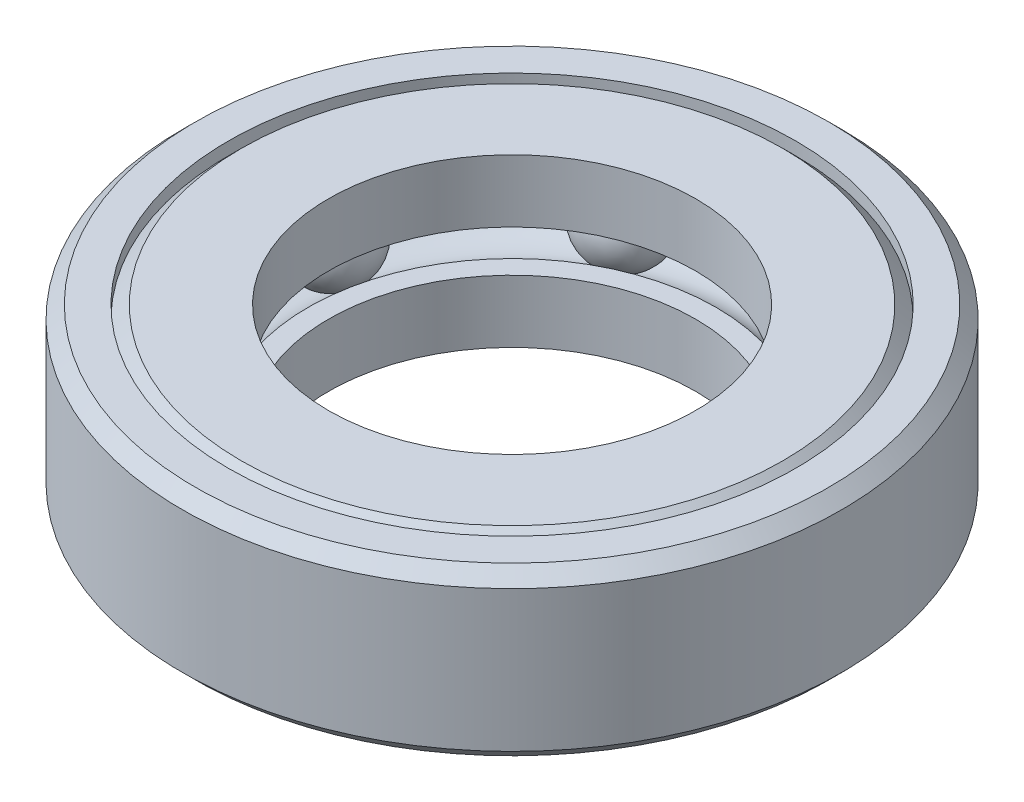
ISO-10303-21;
HEADER;
FILE_DESCRIPTION(('STEP AP214'),'2;1');
FILE_NAME('part.step','',(''),(''),'','','');
FILE_SCHEMA(('AUTOMOTIVE_DESIGN { 1 0 10303 214 1 1 1 1 }'));
ENDSEC;
DATA;
#1=APPLICATION_CONTEXT('core data for automotive mechanical design processes');
#2=APPLICATION_PROTOCOL_DEFINITION('international standard','automotive_design',2000,#1);
#3=PRODUCT_CONTEXT('',#1,'mechanical');
#4=PRODUCT('Part','Part','',(#3));
#5=PRODUCT_RELATED_PRODUCT_CATEGORY('part','',(#4));
#6=PRODUCT_DEFINITION_FORMATION('','',#4);
#7=PRODUCT_DEFINITION_CONTEXT('part definition',#1,'design');
#8=PRODUCT_DEFINITION('design','',#6,#7);
#9=PRODUCT_DEFINITION_SHAPE('','',#8);
#10=(LENGTH_UNIT() NAMED_UNIT(*) SI_UNIT(.MILLI.,.METRE.));
#11=(NAMED_UNIT(*) PLANE_ANGLE_UNIT() SI_UNIT($,.RADIAN.));
#12=(NAMED_UNIT(*) SI_UNIT($,.STERADIAN.) SOLID_ANGLE_UNIT());
#13=UNCERTAINTY_MEASURE_WITH_UNIT(LENGTH_MEASURE(1.E-05),#10,'distance_accuracy_value','');
#14=(GEOMETRIC_REPRESENTATION_CONTEXT(3) GLOBAL_UNCERTAINTY_ASSIGNED_CONTEXT((#13)) GLOBAL_UNIT_ASSIGNED_CONTEXT((#10,
#11,#12)) REPRESENTATION_CONTEXT('',''));
#15=CARTESIAN_POINT('',(0.,0.,0.));
#16=DIRECTION('',(0.,0.,1.));
#17=DIRECTION('',(1.,0.,0.));
#18=AXIS2_PLACEMENT_3D('',#15,#16,#17);
#19=CARTESIAN_POINT('',(17.8571532207388,0.,14.2406044947352));
#20=DIRECTION('',(0.,1.,0.));
#21=DIRECTION('',(-0.781831482468022,0.,-0.623489801858743));
#22=AXIS2_PLACEMENT_3D('',#19,#20,#21);
#23=SPHERICAL_SURFACE('',#22,3.96875);
#24=CARTESIAN_POINT('',(17.8571532207388,3.96875,14.2406044947352));
#25=VERTEX_POINT('',#24);
#26=VERTEX_LOOP('',#25);
#27=FACE_BOUND('',#26,.T.);
#28=ADVANCED_FACE('F42',(#27),#23,.T.);
#29=CLOSED_SHELL('',(#28));
#30=MANIFOLD_SOLID_BREP('B2',#29);
#31=CARTESIAN_POINT('',(22.2675058467192,0.,-5.08241290045794));
#32=DIRECTION('',(0.,1.,0.));
#33=DIRECTION('',(-0.974927912181826,0.,0.222520933956305));
#34=AXIS2_PLACEMENT_3D('',#31,#32,#33);
#35=SPHERICAL_SURFACE('',#34,3.96875);
#36=CARTESIAN_POINT('',(22.2675058467192,3.96875,-5.08241290045794));
#37=VERTEX_POINT('',#36);
#38=VERTEX_LOOP('',#37);
#39=FACE_BOUND('',#38,.T.);
#40=ADVANCED_FACE('F59',(#39),#35,.T.);
#41=CLOSED_SHELL('',(#40));
#42=MANIFOLD_SOLID_BREP('B6',#41);
#43=CARTESIAN_POINT('',(9.90997239577943,0.,-20.5782697192768));
#44=DIRECTION('',(0.,1.,0.));
#45=DIRECTION('',(-0.433883739117565,0.,0.900968867902416));
#46=AXIS2_PLACEMENT_3D('',#43,#44,#45);
#47=SPHERICAL_SURFACE('',#46,3.96875);
#48=CARTESIAN_POINT('',(9.90997239577943,3.96875000000001,-20.5782697192768));
#49=VERTEX_POINT('',#48);
#50=VERTEX_LOOP('',#49);
#51=FACE_BOUND('',#50,.T.);
#52=ADVANCED_FACE('F76',(#51),#47,.T.);
#53=CLOSED_SHELL('',(#52));
#54=MANIFOLD_SOLID_BREP('B38',#53);
#55=CARTESIAN_POINT('',(-9.90997239577914,0.,-20.5782697192769));
#56=DIRECTION('',(0.,1.,0.));
#57=DIRECTION('',(0.433883739117553,0.,0.900968867902422));
#58=AXIS2_PLACEMENT_3D('',#55,#56,#57);
#59=SPHERICAL_SURFACE('',#58,3.96875);
#60=CARTESIAN_POINT('',(-9.90997239577914,3.96875000000001,-20.5782697192769));
#61=VERTEX_POINT('',#60);
#62=VERTEX_LOOP('',#61);
#63=FACE_BOUND('',#62,.T.);
#64=ADVANCED_FACE('F93',(#63),#59,.T.);
#65=CLOSED_SHELL('',(#64));
#66=MANIFOLD_SOLID_BREP('B55',#65);
#67=CARTESIAN_POINT('',(-22.2675058467191,0.,-5.08241290045824));
#68=DIRECTION('',(0.,1.,0.));
#69=DIRECTION('',(0.974927912181823,0.,0.222520933956318));
#70=AXIS2_PLACEMENT_3D('',#67,#68,#69);
#71=SPHERICAL_SURFACE('',#70,3.96875);
#72=CARTESIAN_POINT('',(-22.2675058467191,3.96875,-5.08241290045824));
#73=VERTEX_POINT('',#72);
#74=VERTEX_LOOP('',#73);
#75=FACE_BOUND('',#74,.T.);
#76=ADVANCED_FACE('F110',(#75),#71,.T.);
#77=CLOSED_SHELL('',(#76));
#78=MANIFOLD_SOLID_BREP('B72',#77);
#79=CARTESIAN_POINT('',(-17.857153220739,0.,14.240604494735));
#80=DIRECTION('',(0.,1.,0.));
#81=DIRECTION('',(0.781831482468031,0.,-0.623489801858732));
#82=AXIS2_PLACEMENT_3D('',#79,#80,#81);
#83=SPHERICAL_SURFACE('',#82,3.96875);
#84=CARTESIAN_POINT('',(-17.857153220739,3.96875,14.240604494735));
#85=VERTEX_POINT('',#84);
#86=VERTEX_LOOP('',#85);
#87=FACE_BOUND('',#86,.T.);
#88=ADVANCED_FACE('F127',(#87),#83,.T.);
#89=CLOSED_SHELL('',(#88));
#90=MANIFOLD_SOLID_BREP('B89',#89);
#91=CARTESIAN_POINT('',(0.,0.,22.84015625));
#92=DIRECTION('',(0.,1.,0.));
#93=DIRECTION('',(0.,0.,-1.));
#94=AXIS2_PLACEMENT_3D('',#91,#92,#93);
#95=SPHERICAL_SURFACE('',#94,3.96875);
#96=CARTESIAN_POINT('',(0.,3.96875,22.84015625));
#97=VERTEX_POINT('',#96);
#98=VERTEX_LOOP('',#97);
#99=FACE_BOUND('',#98,.T.);
#100=ADVANCED_FACE('F146',(#99),#95,.T.);
#101=CLOSED_SHELL('',(#100));
#102=MANIFOLD_SOLID_BREP('B106',#101);
#103=CARTESIAN_POINT('',(0.,5.47163488649767,0.));
#104=DIRECTION('',(0.,-1.,0.));
#105=DIRECTION('',(0.,0.,-1.));
#106=AXIS2_PLACEMENT_3D('',#103,#104,#105);
#107=CONICAL_SURFACE('',#106,28.2178125,0.785398163397453);
#108=CARTESIAN_POINT('',(0.,6.70456744324884,0.));
#109=DIRECTION('',(0.,-1.,0.));
#110=DIRECTION('',(0.,0.,-1.));
#111=AXIS2_PLACEMENT_3D('',#108,#109,#110);
#112=CIRCLE('',#111,26.9848799432488);
#113=CARTESIAN_POINT('',(0.,6.70456744324884,-26.9848799432488));
#114=VERTEX_POINT('',#113);
#115=EDGE_CURVE('E145',#114,#114,#112,.T.);
#116=ORIENTED_EDGE('',*,*,#115,.F.);
#117=EDGE_LOOP('',(#116));
#118=FACE_BOUND('',#117,.T.);
#119=CARTESIAN_POINT('',(0.,5.47163488649767,0.));
#120=DIRECTION('',(0.,-1.,0.));
#121=DIRECTION('',(0.,0.,-1.));
#122=AXIS2_PLACEMENT_3D('',#119,#120,#121);
#123=CIRCLE('',#122,28.2178125);
#124=CARTESIAN_POINT('',(0.,5.47163488649768,-28.2178125));
#125=VERTEX_POINT('',#124);
#126=EDGE_CURVE('E199',#125,#125,#123,.T.);
#127=ORIENTED_EDGE('',*,*,#126,.T.);
#128=EDGE_LOOP('',(#127));
#129=FACE_BOUND('',#128,.T.);
#130=ADVANCED_FACE('F165',(#118,#129),#107,.F.);
#131=CARTESIAN_POINT('',(0.,-7.93750000000001,0.));
#132=DIRECTION('',(0.,-1.,0.));
#133=DIRECTION('',(0.,0.,-1.));
#134=AXIS2_PLACEMENT_3D('',#131,#132,#133);
#135=CYLINDRICAL_SURFACE('',#134,26.9848799432488);
#136=CARTESIAN_POINT('',(0.,7.9375,0.));
#137=DIRECTION('',(0.,-1.,0.));
#138=DIRECTION('',(0.,0.,-1.));
#139=AXIS2_PLACEMENT_3D('',#136,#137,#138);
#140=CIRCLE('',#139,26.9848799432488);
#141=CARTESIAN_POINT('',(0.,7.93750000000001,-26.9848799432488));
#142=VERTEX_POINT('',#141);
#143=EDGE_CURVE('E171',#142,#142,#140,.T.);
#144=ORIENTED_EDGE('',*,*,#143,.F.);
#145=EDGE_LOOP('',(#144));
#146=FACE_BOUND('',#145,.T.);
#147=ORIENTED_EDGE('',*,*,#115,.T.);
#148=EDGE_LOOP('',(#147));
#149=FACE_BOUND('',#148,.T.);
#150=ADVANCED_FACE('F248',(#146,#149),#135,.F.);
#151=CARTESIAN_POINT('',(0.,7.9375,30.1201924432488));
#152=DIRECTION('',(0.,-1.,0.));
#153=DIRECTION('',(0.,0.,-1.));
#154=AXIS2_PLACEMENT_3D('',#151,#152,#153);
#155=PLANE('',#154);
#156=CARTESIAN_POINT('',(0.,7.93750000000001,0.));
#157=DIRECTION('',(0.,-1.,0.));
#158=DIRECTION('',(0.,0.,-1.));
#159=AXIS2_PLACEMENT_3D('',#156,#157,#158);
#160=CIRCLE('',#159,30.1201924432488);
#161=CARTESIAN_POINT('',(0.,7.93750000000001,-30.1201924432488));
#162=VERTEX_POINT('',#161);
#163=EDGE_CURVE('E175',#162,#162,#160,.T.);
#164=ORIENTED_EDGE('',*,*,#163,.F.);
#165=EDGE_LOOP('',(#164));
#166=FACE_BOUND('',#165,.T.);
#167=ORIENTED_EDGE('',*,*,#143,.T.);
#168=EDGE_LOOP('',(#167));
#169=FACE_BOUND('',#168,.T.);
#170=ADVANCED_FACE('F243',(#166,#169),#155,.F.);
#171=CARTESIAN_POINT('',(0.,7.93750000000001,0.));
#172=DIRECTION('',(0.,-1.,0.));
#173=DIRECTION('',(0.,0.,-1.));
#174=AXIS2_PLACEMENT_3D('',#171,#172,#173);
#175=CONICAL_SURFACE('',#174,30.1201924432488,0.785398163397455);
#176=CARTESIAN_POINT('',(0.,6.70456744324884,0.));
#177=DIRECTION('',(0.,-1.,0.));
#178=DIRECTION('',(0.,0.,-1.));
#179=AXIS2_PLACEMENT_3D('',#176,#177,#178);
#180=CIRCLE('',#179,31.353125);
#181=CARTESIAN_POINT('',(0.,6.70456744324884,-31.353125));
#182=VERTEX_POINT('',#181);
#183=EDGE_CURVE('E179',#182,#182,#180,.T.);
#184=ORIENTED_EDGE('',*,*,#183,.F.);
#185=EDGE_LOOP('',(#184));
#186=FACE_BOUND('',#185,.T.);
#187=ORIENTED_EDGE('',*,*,#163,.T.);
#188=EDGE_LOOP('',(#187));
#189=FACE_BOUND('',#188,.T.);
#190=ADVANCED_FACE('F237',(#186,#189),#175,.T.);
#191=CARTESIAN_POINT('',(0.,-7.93750000000001,0.));
#192=DIRECTION('',(0.,-1.,0.));
#193=DIRECTION('',(0.,0.,-1.));
#194=AXIS2_PLACEMENT_3D('',#191,#192,#193);
#195=CYLINDRICAL_SURFACE('',#194,31.353125);
#196=CARTESIAN_POINT('',(0.,-6.70456744324885,0.));
#197=DIRECTION('',(0.,-1.,0.));
#198=DIRECTION('',(0.,0.,-1.));
#199=AXIS2_PLACEMENT_3D('',#196,#197,#198);
#200=CIRCLE('',#199,31.353125);
#201=CARTESIAN_POINT('',(0.,-6.70456744324885,-31.353125));
#202=VERTEX_POINT('',#201);
#203=EDGE_CURVE('E184',#202,#202,#200,.T.);
#204=ORIENTED_EDGE('',*,*,#203,.F.);
#205=EDGE_LOOP('',(#204));
#206=FACE_BOUND('',#205,.T.);
#207=ORIENTED_EDGE('',*,*,#183,.T.);
#208=EDGE_LOOP('',(#207));
#209=FACE_BOUND('',#208,.T.);
#210=ADVANCED_FACE('F231',(#206,#209),#195,.T.);
#211=CARTESIAN_POINT('',(0.,-6.70456744324885,0.));
#212=DIRECTION('',(0.,1.,0.));
#213=DIRECTION('',(0.,0.,1.));
#214=AXIS2_PLACEMENT_3D('',#211,#212,#213);
#215=CONICAL_SURFACE('',#214,31.353125,0.785398163397455);
#216=CARTESIAN_POINT('',(0.,-7.93750000000002,0.));
#217=DIRECTION('',(0.,-1.,0.));
#218=DIRECTION('',(0.,0.,-1.));
#219=AXIS2_PLACEMENT_3D('',#216,#217,#218);
#220=CIRCLE('',#219,30.1201924432488);
#221=CARTESIAN_POINT('',(0.,-7.93750000000002,-30.1201924432488));
#222=VERTEX_POINT('',#221);
#223=EDGE_CURVE('E187',#222,#222,#220,.T.);
#224=ORIENTED_EDGE('',*,*,#223,.F.);
#225=EDGE_LOOP('',(#224));
#226=FACE_BOUND('',#225,.T.);
#227=ORIENTED_EDGE('',*,*,#203,.T.);
#228=EDGE_LOOP('',(#227));
#229=FACE_BOUND('',#228,.T.);
#230=ADVANCED_FACE('F225',(#226,#229),#215,.T.);
#231=CARTESIAN_POINT('',(0.,-7.93750000000002,30.1201924432488));
#232=DIRECTION('',(0.,1.,0.));
#233=DIRECTION('',(0.,0.,1.));
#234=AXIS2_PLACEMENT_3D('',#231,#232,#233);
#235=PLANE('',#234);
#236=CARTESIAN_POINT('',(0.,-7.93750000000002,0.));
#237=DIRECTION('',(0.,-1.,0.));
#238=DIRECTION('',(0.,0.,-1.));
#239=AXIS2_PLACEMENT_3D('',#236,#237,#238);
#240=CIRCLE('',#239,26.9848799432488);
#241=CARTESIAN_POINT('',(0.,-7.93750000000001,-26.9848799432488));
#242=VERTEX_POINT('',#241);
#243=EDGE_CURVE('E190',#242,#242,#240,.T.);
#244=ORIENTED_EDGE('',*,*,#243,.F.);
#245=EDGE_LOOP('',(#244));
#246=FACE_BOUND('',#245,.T.);
#247=ORIENTED_EDGE('',*,*,#223,.T.);
#248=EDGE_LOOP('',(#247));
#249=FACE_BOUND('',#248,.T.);
#250=ADVANCED_FACE('F219',(#246,#249),#235,.F.);
#251=CARTESIAN_POINT('',(0.,-7.93750000000001,0.));
#252=DIRECTION('',(0.,-1.,0.));
#253=DIRECTION('',(0.,0.,-1.));
#254=AXIS2_PLACEMENT_3D('',#251,#252,#253);
#255=CYLINDRICAL_SURFACE('',#254,26.9848799432488);
#256=CARTESIAN_POINT('',(0.,-6.70456744324885,0.));
#257=DIRECTION('',(0.,-1.,0.));
#258=DIRECTION('',(0.,0.,-1.));
#259=AXIS2_PLACEMENT_3D('',#256,#257,#258);
#260=CIRCLE('',#259,26.9848799432488);
#261=CARTESIAN_POINT('',(0.,-6.70456744324885,-26.9848799432488));
#262=VERTEX_POINT('',#261);
#263=EDGE_CURVE('E193',#262,#262,#260,.T.);
#264=ORIENTED_EDGE('',*,*,#263,.F.);
#265=EDGE_LOOP('',(#264));
#266=FACE_BOUND('',#265,.T.);
#267=ORIENTED_EDGE('',*,*,#243,.T.);
#268=EDGE_LOOP('',(#267));
#269=FACE_BOUND('',#268,.T.);
#270=ADVANCED_FACE('F213',(#266,#269),#255,.F.);
#271=CARTESIAN_POINT('',(0.,-6.70456744324885,0.));
#272=DIRECTION('',(0.,1.,0.));
#273=DIRECTION('',(0.,0.,1.));
#274=AXIS2_PLACEMENT_3D('',#271,#272,#273);
#275=CONICAL_SURFACE('',#274,26.9848799432488,0.785398163397447);
#276=CARTESIAN_POINT('',(0.,-5.47163488649768,0.));
#277=DIRECTION('',(0.,-1.,0.));
#278=DIRECTION('',(0.,0.,-1.));
#279=AXIS2_PLACEMENT_3D('',#276,#277,#278);
#280=CIRCLE('',#279,28.2178125);
#281=CARTESIAN_POINT('',(0.,-5.47163488649767,-28.2178125));
#282=VERTEX_POINT('',#281);
#283=EDGE_CURVE('E196',#282,#282,#280,.T.);
#284=ORIENTED_EDGE('',*,*,#283,.F.);
#285=EDGE_LOOP('',(#284));
#286=FACE_BOUND('',#285,.T.);
#287=ORIENTED_EDGE('',*,*,#263,.T.);
#288=EDGE_LOOP('',(#287));
#289=FACE_BOUND('',#288,.T.);
#290=ADVANCED_FACE('F207',(#286,#289),#275,.F.);
#291=CARTESIAN_POINT('',(0.,-7.93750000000001,0.));
#292=DIRECTION('',(0.,-1.,0.));
#293=DIRECTION('',(0.,0.,-1.));
#294=AXIS2_PLACEMENT_3D('',#291,#292,#293);
#295=CYLINDRICAL_SURFACE('',#294,28.2178125);
#296=ORIENTED_EDGE('',*,*,#126,.F.);
#297=EDGE_LOOP('',(#296));
#298=FACE_BOUND('',#297,.T.);
#299=ORIENTED_EDGE('',*,*,#283,.T.);
#300=EDGE_LOOP('',(#299));
#301=FACE_BOUND('',#300,.T.);
#302=ADVANCED_FACE('F204',(#298,#301),#295,.F.);
#303=CLOSED_SHELL('',(#130,#150,#170,#190,#210,#230,#250,#270,#290,#302));
#304=MANIFOLD_SOLID_BREP('B123',#303);
#305=CARTESIAN_POINT('',(0.,0.,0.));
#306=DIRECTION('',(0.,-1.,0.));
#307=DIRECTION('',(0.,0.,-1.));
#308=AXIS2_PLACEMENT_3D('',#305,#306,#307);
#309=TOROIDAL_SURFACE('',#308,22.84015625,3.96875000000001);
#310=CARTESIAN_POINT('',(0.,-1.98437500000002,0.));
#311=DIRECTION('',(0.,-1.,0.));
#312=DIRECTION('',(0.,0.,-1.));
#313=AXIS2_PLACEMENT_3D('',#310,#311,#312);
#314=CIRCLE('',#313,26.2771945712695);
#315=CARTESIAN_POINT('',(0.,-1.98437500000001,-26.2771945712695));
#316=VERTEX_POINT('',#315);
#317=EDGE_CURVE('E164',#316,#316,#314,.T.);
#318=ORIENTED_EDGE('',*,*,#317,.F.);
#319=EDGE_LOOP('',(#318));
#320=FACE_BOUND('',#319,.T.);
#321=CARTESIAN_POINT('',(0.,-1.98437500000002,0.));
#322=DIRECTION('',(0.,-1.,0.));
#323=DIRECTION('',(0.,0.,-1.));
#324=AXIS2_PLACEMENT_3D('',#321,#322,#323);
#325=CIRCLE('',#324,19.4031179287305);
#326=CARTESIAN_POINT('',(0.,-1.98437500000001,-19.4031179287305));
#327=VERTEX_POINT('',#326);
#328=EDGE_CURVE('E329',#327,#327,#325,.T.);
#329=ORIENTED_EDGE('',*,*,#328,.T.);
#330=EDGE_LOOP('',(#329));
#331=FACE_BOUND('',#330,.T.);
#332=ADVANCED_FACE('F304',(#320,#331),#309,.F.);
#333=CARTESIAN_POINT('',(0.,-1.98437500000002,26.2771945712695));
#334=DIRECTION('',(0.,-1.,0.));
#335=DIRECTION('',(0.,0.,-1.));
#336=AXIS2_PLACEMENT_3D('',#333,#334,#335);
#337=PLANE('',#336);
#338=CARTESIAN_POINT('',(0.,-1.98437500000002,0.));
#339=DIRECTION('',(0.,-1.,0.));
#340=DIRECTION('',(0.,0.,-1.));
#341=AXIS2_PLACEMENT_3D('',#338,#339,#340);
#342=CIRCLE('',#341,28.2178125);
#343=CARTESIAN_POINT('',(0.,-1.98437500000001,-28.2178125));
#344=VERTEX_POINT('',#343);
#345=EDGE_CURVE('E310',#344,#344,#342,.T.);
#346=ORIENTED_EDGE('',*,*,#345,.F.);
#347=EDGE_LOOP('',(#346));
#348=FACE_BOUND('',#347,.T.);
#349=ORIENTED_EDGE('',*,*,#317,.T.);
#350=EDGE_LOOP('',(#349));
#351=FACE_BOUND('',#350,.T.);
#352=ADVANCED_FACE('F360',(#348,#351),#337,.F.);
#353=CARTESIAN_POINT('',(0.,-7.93750000000001,0.));
#354=DIRECTION('',(0.,-1.,0.));
#355=DIRECTION('',(0.,0.,-1.));
#356=AXIS2_PLACEMENT_3D('',#353,#354,#355);
#357=CYLINDRICAL_SURFACE('',#356,28.2178125);
#358=CARTESIAN_POINT('',(0.,-5.47163488649769,0.));
#359=DIRECTION('',(0.,-1.,0.));
#360=DIRECTION('',(0.,0.,-1.));
#361=AXIS2_PLACEMENT_3D('',#358,#359,#360);
#362=CIRCLE('',#361,28.2178125);
#363=CARTESIAN_POINT('',(0.,-5.47163488649769,-28.2178125));
#364=VERTEX_POINT('',#363);
#365=EDGE_CURVE('E314',#364,#364,#362,.T.);
#366=ORIENTED_EDGE('',*,*,#365,.F.);
#367=EDGE_LOOP('',(#366));
#368=FACE_BOUND('',#367,.T.);
#369=ORIENTED_EDGE('',*,*,#345,.T.);
#370=EDGE_LOOP('',(#369));
#371=FACE_BOUND('',#370,.T.);
#372=ADVANCED_FACE('F355',(#368,#371),#357,.T.);
#373=CARTESIAN_POINT('',(0.,-5.47163488649769,0.));
#374=DIRECTION('',(0.,1.,0.));
#375=DIRECTION('',(0.,0.,1.));
#376=AXIS2_PLACEMENT_3D('',#373,#374,#375);
#377=CONICAL_SURFACE('',#376,28.2178125,0.78539816339745);
#378=CARTESIAN_POINT('',(0.,-7.93750000000002,0.));
#379=DIRECTION('',(0.,-1.,0.));
#380=DIRECTION('',(0.,0.,-1.));
#381=AXIS2_PLACEMENT_3D('',#378,#379,#380);
#382=CIRCLE('',#381,25.7519473864977);
#383=CARTESIAN_POINT('',(0.,-7.93750000000001,-25.7519473864977));
#384=VERTEX_POINT('',#383);
#385=EDGE_CURVE('E318',#384,#384,#382,.T.);
#386=ORIENTED_EDGE('',*,*,#385,.F.);
#387=EDGE_LOOP('',(#386));
#388=FACE_BOUND('',#387,.T.);
#389=ORIENTED_EDGE('',*,*,#365,.T.);
#390=EDGE_LOOP('',(#389));
#391=FACE_BOUND('',#390,.T.);
#392=ADVANCED_FACE('F349',(#388,#391),#377,.T.);
#393=CARTESIAN_POINT('',(0.,-7.93750000000002,25.7519473864977));
#394=DIRECTION('',(0.,1.,0.));
#395=DIRECTION('',(0.,0.,1.));
#396=AXIS2_PLACEMENT_3D('',#393,#394,#395);
#397=PLANE('',#396);
#398=CARTESIAN_POINT('',(0.,-7.93750000000001,0.));
#399=DIRECTION('',(0.,-1.,0.));
#400=DIRECTION('',(0.,0.,-1.));
#401=AXIS2_PLACEMENT_3D('',#398,#399,#400);
#402=CIRCLE('',#401,17.4625);
#403=CARTESIAN_POINT('',(0.,-7.93750000000001,-17.4625));
#404=VERTEX_POINT('',#403);
#405=EDGE_CURVE('E323',#404,#404,#402,.T.);
#406=ORIENTED_EDGE('',*,*,#405,.F.);
#407=EDGE_LOOP('',(#406));
#408=FACE_BOUND('',#407,.T.);
#409=ORIENTED_EDGE('',*,*,#385,.T.);
#410=EDGE_LOOP('',(#409));
#411=FACE_BOUND('',#410,.T.);
#412=ADVANCED_FACE('F343',(#408,#411),#397,.F.);
#413=CARTESIAN_POINT('',(0.,-7.93750000000001,0.));
#414=DIRECTION('',(0.,-1.,0.));
#415=DIRECTION('',(0.,0.,-1.));
#416=AXIS2_PLACEMENT_3D('',#413,#414,#415);
#417=CYLINDRICAL_SURFACE('',#416,17.4625);
#418=CARTESIAN_POINT('',(0.,-1.98437500000002,0.));
#419=DIRECTION('',(0.,-1.,0.));
#420=DIRECTION('',(0.,0.,-1.));
#421=AXIS2_PLACEMENT_3D('',#418,#419,#420);
#422=CIRCLE('',#421,17.4625);
#423=CARTESIAN_POINT('',(0.,-1.98437500000001,-17.4625));
#424=VERTEX_POINT('',#423);
#425=EDGE_CURVE('E326',#424,#424,#422,.T.);
#426=ORIENTED_EDGE('',*,*,#425,.F.);
#427=EDGE_LOOP('',(#426));
#428=FACE_BOUND('',#427,.T.);
#429=ORIENTED_EDGE('',*,*,#405,.T.);
#430=EDGE_LOOP('',(#429));
#431=FACE_BOUND('',#430,.T.);
#432=ADVANCED_FACE('F337',(#428,#431),#417,.F.);
#433=CARTESIAN_POINT('',(0.,-1.98437500000002,17.4625));
#434=DIRECTION('',(0.,-1.,0.));
#435=DIRECTION('',(0.,0.,-1.));
#436=AXIS2_PLACEMENT_3D('',#433,#434,#435);
#437=PLANE('',#436);
#438=ORIENTED_EDGE('',*,*,#328,.F.);
#439=EDGE_LOOP('',(#438));
#440=FACE_BOUND('',#439,.T.);
#441=ORIENTED_EDGE('',*,*,#425,.T.);
#442=EDGE_LOOP('',(#441));
#443=FACE_BOUND('',#442,.T.);
#444=ADVANCED_FACE('F334',(#440,#443),#437,.F.);
#445=CLOSED_SHELL('',(#332,#352,#372,#392,#412,#432,#444));
#446=MANIFOLD_SOLID_BREP('B140',#445);
#447=CARTESIAN_POINT('',(0.,0.,0.));
#448=DIRECTION('',(0.,-1.,0.));
#449=DIRECTION('',(0.,0.,-1.));
#450=AXIS2_PLACEMENT_3D('',#447,#448,#449);
#451=TOROIDAL_SURFACE('',#450,22.84015625,3.96875);
#452=CARTESIAN_POINT('',(0.,1.984375,0.));
#453=DIRECTION('',(0.,-1.,0.));
#454=DIRECTION('',(0.,0.,-1.));
#455=AXIS2_PLACEMENT_3D('',#452,#453,#454);
#456=CIRCLE('',#455,19.4031179287305);
#457=CARTESIAN_POINT('',(0.,1.984375,-19.4031179287305));
#458=VERTEX_POINT('',#457);
#459=EDGE_CURVE('E422',#458,#458,#456,.T.);
#460=ORIENTED_EDGE('',*,*,#459,.F.);
#461=EDGE_LOOP('',(#460));
#462=FACE_BOUND('',#461,.T.);
#463=CARTESIAN_POINT('',(0.,1.984375,0.));
#464=DIRECTION('',(0.,-1.,0.));
#465=DIRECTION('',(0.,0.,-1.));
#466=AXIS2_PLACEMENT_3D('',#463,#464,#465);
#467=CIRCLE('',#466,26.2771945712695);
#468=CARTESIAN_POINT('',(0.,1.984375,-26.2771945712695));
#469=VERTEX_POINT('',#468);
#470=EDGE_CURVE('E303',#469,#469,#467,.T.);
#471=ORIENTED_EDGE('',*,*,#470,.T.);
#472=EDGE_LOOP('',(#471));
#473=FACE_BOUND('',#472,.T.);
#474=ADVANCED_FACE('F397',(#462,#473),#451,.F.);
#475=CARTESIAN_POINT('',(0.,1.984375,26.2771945712695));
#476=DIRECTION('',(0.,1.,0.));
#477=DIRECTION('',(0.,0.,1.));
#478=AXIS2_PLACEMENT_3D('',#475,#476,#477);
#479=PLANE('',#478);
#480=ORIENTED_EDGE('',*,*,#470,.F.);
#481=EDGE_LOOP('',(#480));
#482=FACE_BOUND('',#481,.T.);
#483=CARTESIAN_POINT('',(0.,1.984375,0.));
#484=DIRECTION('',(0.,-1.,0.));
#485=DIRECTION('',(0.,0.,-1.));
#486=AXIS2_PLACEMENT_3D('',#483,#484,#485);
#487=CIRCLE('',#486,28.2178125);
#488=CARTESIAN_POINT('',(0.,1.98437500000001,-28.2178125));
#489=VERTEX_POINT('',#488);
#490=EDGE_CURVE('E403',#489,#489,#487,.T.);
#491=ORIENTED_EDGE('',*,*,#490,.T.);
#492=EDGE_LOOP('',(#491));
#493=FACE_BOUND('',#492,.T.);
#494=ADVANCED_FACE('F429',(#482,#493),#479,.F.);
#495=CARTESIAN_POINT('',(0.,-7.93750000000001,0.));
#496=DIRECTION('',(0.,-1.,0.));
#497=DIRECTION('',(0.,0.,-1.));
#498=AXIS2_PLACEMENT_3D('',#495,#496,#497);
#499=CYLINDRICAL_SURFACE('',#498,28.2178125);
#500=ORIENTED_EDGE('',*,*,#490,.F.);
#501=EDGE_LOOP('',(#500));
#502=FACE_BOUND('',#501,.T.);
#503=CARTESIAN_POINT('',(0.,5.47163488649767,0.));
#504=DIRECTION('',(0.,-1.,0.));
#505=DIRECTION('',(0.,0.,-1.));
#506=AXIS2_PLACEMENT_3D('',#503,#504,#505);
#507=CIRCLE('',#506,28.2178125);
#508=CARTESIAN_POINT('',(0.,5.47163488649768,-28.2178125));
#509=VERTEX_POINT('',#508);
#510=EDGE_CURVE('E407',#509,#509,#507,.T.);
#511=ORIENTED_EDGE('',*,*,#510,.T.);
#512=EDGE_LOOP('',(#511));
#513=FACE_BOUND('',#512,.T.);
#514=ADVANCED_FACE('F433',(#502,#513),#499,.T.);
#515=CARTESIAN_POINT('',(0.,7.9375,0.));
#516=DIRECTION('',(0.,-1.,0.));
#517=DIRECTION('',(0.,0.,-1.));
#518=AXIS2_PLACEMENT_3D('',#515,#516,#517);
#519=CONICAL_SURFACE('',#518,25.7519473864977,0.785398163397451);
#520=ORIENTED_EDGE('',*,*,#510,.F.);
#521=EDGE_LOOP('',(#520));
#522=FACE_BOUND('',#521,.T.);
#523=CARTESIAN_POINT('',(0.,7.9375,0.));
#524=DIRECTION('',(0.,-1.,0.));
#525=DIRECTION('',(0.,0.,-1.));
#526=AXIS2_PLACEMENT_3D('',#523,#524,#525);
#527=CIRCLE('',#526,25.7519473864977);
#528=CARTESIAN_POINT('',(0.,7.93750000000001,-25.7519473864977));
#529=VERTEX_POINT('',#528);
#530=EDGE_CURVE('E411',#529,#529,#527,.T.);
#531=ORIENTED_EDGE('',*,*,#530,.T.);
#532=EDGE_LOOP('',(#531));
#533=FACE_BOUND('',#532,.T.);
#534=ADVANCED_FACE('F438',(#522,#533),#519,.T.);
#535=CARTESIAN_POINT('',(0.,7.9375,25.7519473864977));
#536=DIRECTION('',(0.,-1.,0.));
#537=DIRECTION('',(0.,0.,-1.));
#538=AXIS2_PLACEMENT_3D('',#535,#536,#537);
#539=PLANE('',#538);
#540=ORIENTED_EDGE('',*,*,#530,.F.);
#541=EDGE_LOOP('',(#540));
#542=FACE_BOUND('',#541,.T.);
#543=CARTESIAN_POINT('',(0.,7.9375,0.));
#544=DIRECTION('',(0.,-1.,0.));
#545=DIRECTION('',(0.,0.,-1.));
#546=AXIS2_PLACEMENT_3D('',#543,#544,#545);
#547=CIRCLE('',#546,17.4625);
#548=CARTESIAN_POINT('',(0.,7.9375,-17.4625));
#549=VERTEX_POINT('',#548);
#550=EDGE_CURVE('E416',#549,#549,#547,.T.);
#551=ORIENTED_EDGE('',*,*,#550,.T.);
#552=EDGE_LOOP('',(#551));
#553=FACE_BOUND('',#552,.T.);
#554=ADVANCED_FACE('F444',(#542,#553),#539,.F.);
#555=CARTESIAN_POINT('',(0.,-7.93750000000001,0.));
#556=DIRECTION('',(0.,-1.,0.));
#557=DIRECTION('',(0.,0.,-1.));
#558=AXIS2_PLACEMENT_3D('',#555,#556,#557);
#559=CYLINDRICAL_SURFACE('',#558,17.4625);
#560=ORIENTED_EDGE('',*,*,#550,.F.);
#561=EDGE_LOOP('',(#560));
#562=FACE_BOUND('',#561,.T.);
#563=CARTESIAN_POINT('',(0.,1.984375,0.));
#564=DIRECTION('',(0.,-1.,0.));
#565=DIRECTION('',(0.,0.,-1.));
#566=AXIS2_PLACEMENT_3D('',#563,#564,#565);
#567=CIRCLE('',#566,17.4625);
#568=CARTESIAN_POINT('',(0.,1.984375,-17.4625));
#569=VERTEX_POINT('',#568);
#570=EDGE_CURVE('E419',#569,#569,#567,.T.);
#571=ORIENTED_EDGE('',*,*,#570,.T.);
#572=EDGE_LOOP('',(#571));
#573=FACE_BOUND('',#572,.T.);
#574=ADVANCED_FACE('F448',(#562,#573),#559,.F.);
#575=CARTESIAN_POINT('',(0.,1.984375,17.4625));
#576=DIRECTION('',(0.,1.,0.));
#577=DIRECTION('',(0.,0.,1.));
#578=AXIS2_PLACEMENT_3D('',#575,#576,#577);
#579=PLANE('',#578);
#580=ORIENTED_EDGE('',*,*,#570,.F.);
#581=EDGE_LOOP('',(#580));
#582=FACE_BOUND('',#581,.T.);
#583=ORIENTED_EDGE('',*,*,#459,.T.);
#584=EDGE_LOOP('',(#583));
#585=FACE_BOUND('',#584,.T.);
#586=ADVANCED_FACE('F426',(#582,#585),#579,.F.);
#587=CLOSED_SHELL('',(#474,#494,#514,#534,#554,#574,#586));
#588=MANIFOLD_SOLID_BREP('B159',#587);
#589=ADVANCED_BREP_SHAPE_REPRESENTATION('',(#18,#30,#42,#54,#66,#78,#90,#102,#304,#446,#588),#14);
#590=SHAPE_DEFINITION_REPRESENTATION(#9,#589);
ENDSEC;
END-ISO-10303-21;
